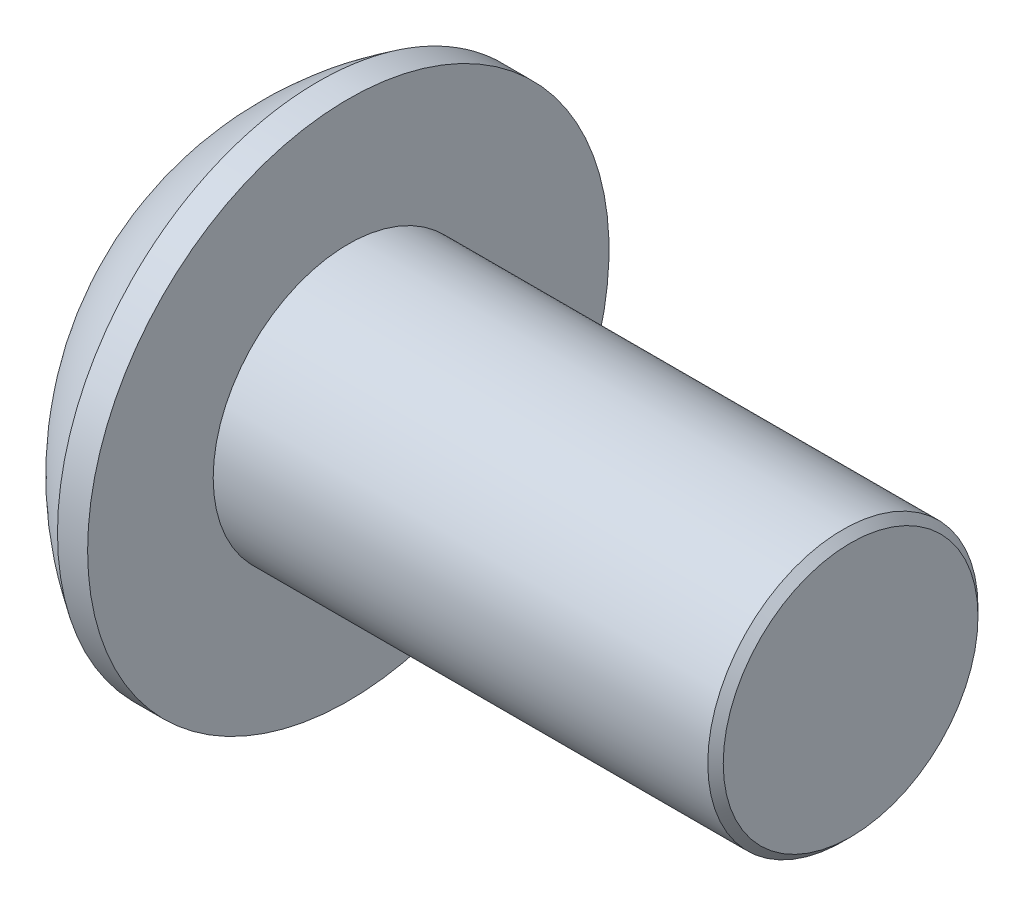
ISO-10303-21;
HEADER;
FILE_DESCRIPTION(('STEP AP214'),'2;1');
FILE_NAME('part.step','',(''),(''),'','','');
FILE_SCHEMA(('AUTOMOTIVE_DESIGN { 1 0 10303 214 1 1 1 1 }'));
ENDSEC;
DATA;
#1=APPLICATION_CONTEXT('core data for automotive mechanical design processes');
#2=APPLICATION_PROTOCOL_DEFINITION('international standard','automotive_design',2000,#1);
#3=PRODUCT_CONTEXT('',#1,'mechanical');
#4=PRODUCT('Part','Part','',(#3));
#5=PRODUCT_RELATED_PRODUCT_CATEGORY('part','',(#4));
#6=PRODUCT_DEFINITION_FORMATION('','',#4);
#7=PRODUCT_DEFINITION_CONTEXT('part definition',#1,'design');
#8=PRODUCT_DEFINITION('design','',#6,#7);
#9=PRODUCT_DEFINITION_SHAPE('','',#8);
#10=(LENGTH_UNIT() NAMED_UNIT(*) SI_UNIT(.MILLI.,.METRE.));
#11=(NAMED_UNIT(*) PLANE_ANGLE_UNIT() SI_UNIT($,.RADIAN.));
#12=(NAMED_UNIT(*) SI_UNIT($,.STERADIAN.) SOLID_ANGLE_UNIT());
#13=UNCERTAINTY_MEASURE_WITH_UNIT(LENGTH_MEASURE(1.E-05),#10,'distance_accuracy_value','');
#14=(GEOMETRIC_REPRESENTATION_CONTEXT(3) GLOBAL_UNCERTAINTY_ASSIGNED_CONTEXT((#13)) GLOBAL_UNIT_ASSIGNED_CONTEXT((#10,
#11,#12)) REPRESENTATION_CONTEXT('',''));
#15=CARTESIAN_POINT('',(0.,0.,0.));
#16=DIRECTION('',(0.,0.,1.));
#17=DIRECTION('',(1.,0.,0.));
#18=AXIS2_PLACEMENT_3D('',#15,#16,#17);
#19=CARTESIAN_POINT('',(1.32080000000034,0.,0.));
#20=DIRECTION('',(-1.,0.,0.));
#21=DIRECTION('',(0.,0.,1.));
#22=AXIS2_PLACEMENT_3D('',#19,#20,#21);
#23=CONICAL_SURFACE('',#22,1.1937999999998,1.04719755119608);
#24=CARTESIAN_POINT('',(2.01004075135902,0.,4.44089209850063E-13));
#25=VERTEX_POINT('',#24);
#26=VERTEX_LOOP('',#25);
#27=FACE_BOUND('',#26,.T.);
#28=CARTESIAN_POINT('',(1.32080000000009,0.,0.));
#29=DIRECTION('',(-1.,0.,0.));
#30=DIRECTION('',(0.,0.,1.));
#31=AXIS2_PLACEMENT_3D('',#28,#29,#30);
#32=CIRCLE('',#31,1.19380000000024);
#33=CARTESIAN_POINT('',(1.32080000000004,-1.03386112703797,0.59690000000006));
#34=VERTEX_POINT('',#33);
#35=CARTESIAN_POINT('',(1.32080000000004,0.,1.19380000000012));
#36=VERTEX_POINT('',#35);
#37=EDGE_CURVE('E18',#34,#36,#32,.T.);
#38=ORIENTED_EDGE('',*,*,#37,.T.);
#39=CARTESIAN_POINT('',(1.32080000000009,0.,0.));
#40=DIRECTION('',(-1.,0.,0.));
#41=DIRECTION('',(0.,0.,1.));
#42=AXIS2_PLACEMENT_3D('',#39,#40,#41);
#43=CIRCLE('',#42,1.19380000000024);
#44=CARTESIAN_POINT('',(1.32080000000004,1.03386112703797,0.596900000000061));
#45=VERTEX_POINT('',#44);
#46=EDGE_CURVE('E139',#36,#45,#43,.T.);
#47=ORIENTED_EDGE('',*,*,#46,.T.);
#48=CARTESIAN_POINT('',(1.32080000000009,0.,0.));
#49=DIRECTION('',(-1.,0.,0.));
#50=DIRECTION('',(0.,0.,1.));
#51=AXIS2_PLACEMENT_3D('',#48,#49,#50);
#52=CIRCLE('',#51,1.19380000000024);
#53=CARTESIAN_POINT('',(1.32080000000004,1.03386112703797,-0.596900000000061));
#54=VERTEX_POINT('',#53);
#55=EDGE_CURVE('E368',#45,#54,#52,.T.);
#56=ORIENTED_EDGE('',*,*,#55,.T.);
#57=CARTESIAN_POINT('',(1.32080000000009,0.,0.));
#58=DIRECTION('',(-1.,0.,0.));
#59=DIRECTION('',(0.,0.,1.));
#60=AXIS2_PLACEMENT_3D('',#57,#58,#59);
#61=CIRCLE('',#60,1.19380000000024);
#62=CARTESIAN_POINT('',(1.32080000000004,1.49457637585666E-12,-1.19380000000012));
#63=VERTEX_POINT('',#62);
#64=EDGE_CURVE('E366',#54,#63,#61,.T.);
#65=ORIENTED_EDGE('',*,*,#64,.T.);
#66=CARTESIAN_POINT('',(1.32080000000009,0.,0.));
#67=DIRECTION('',(-1.,0.,0.));
#68=DIRECTION('',(0.,0.,1.));
#69=AXIS2_PLACEMENT_3D('',#66,#67,#68);
#70=CIRCLE('',#69,1.19380000000024);
#71=CARTESIAN_POINT('',(1.32080000000004,-1.03386112703797,-0.59690000000006));
#72=VERTEX_POINT('',#71);
#73=EDGE_CURVE('E91',#63,#72,#70,.T.);
#74=ORIENTED_EDGE('',*,*,#73,.T.);
#75=CARTESIAN_POINT('',(1.32080000000009,0.,0.));
#76=DIRECTION('',(-1.,0.,0.));
#77=DIRECTION('',(0.,0.,1.));
#78=AXIS2_PLACEMENT_3D('',#75,#76,#77);
#79=CIRCLE('',#78,1.19380000000024);
#80=EDGE_CURVE('E87',#72,#34,#79,.T.);
#81=ORIENTED_EDGE('',*,*,#80,.T.);
#82=EDGE_LOOP('',(#38,#47,#56,#65,#74,#81));
#83=FACE_BOUND('',#82,.T.);
#84=ADVANCED_FACE('F14',(#27,#83),#23,.F.);
#85=CARTESIAN_POINT('',(1.3208,-2.06772225407572,-1.1938));
#86=DIRECTION('',(1.,0.,0.));
#87=DIRECTION('',(0.,0.,-1.));
#88=AXIS2_PLACEMENT_3D('',#85,#86,#87);
#89=PLANE('',#88);
#90=DIRECTION('',(0.,0.5,0.866025403784439));
#91=VECTOR('',#90,1.);
#92=CARTESIAN_POINT('',(1.3208,-1.37848150271715,0.));
#93=LINE('',#92,#91);
#94=CARTESIAN_POINT('',(1.3208,-0.689240751358574,1.1938));
#95=VERTEX_POINT('',#94);
#96=EDGE_CURVE('E99',#95,#34,#93,.F.);
#97=ORIENTED_EDGE('',*,*,#96,.F.);
#98=DIRECTION('',(0.,1.,0.));
#99=VECTOR('',#98,1.);
#100=CARTESIAN_POINT('',(1.3208,-0.689240751358574,1.1938));
#101=LINE('',#100,#99);
#102=EDGE_CURVE('E101',#36,#95,#101,.F.);
#103=ORIENTED_EDGE('',*,*,#102,.F.);
#104=ORIENTED_EDGE('',*,*,#37,.F.);
#105=EDGE_LOOP('',(#97,#103,#104));
#106=FACE_BOUND('',#105,.T.);
#107=ADVANCED_FACE('F97',(#106),#89,.F.);
#108=CARTESIAN_POINT('',(1.3208,-2.06772225407572,-1.1938));
#109=DIRECTION('',(1.,0.,0.));
#110=DIRECTION('',(0.,0.,-1.));
#111=AXIS2_PLACEMENT_3D('',#108,#109,#110);
#112=PLANE('',#111);
#113=DIRECTION('',(0.,-0.5,0.866025403784439));
#114=VECTOR('',#113,1.);
#115=CARTESIAN_POINT('',(1.3208,-0.689240751358574,-1.1938));
#116=LINE('',#115,#114);
#117=CARTESIAN_POINT('',(1.3208,-1.37848150271715,0.));
#118=VERTEX_POINT('',#117);
#119=EDGE_CURVE('E107',#118,#72,#116,.F.);
#120=ORIENTED_EDGE('',*,*,#119,.F.);
#121=DIRECTION('',(0.,0.5,0.866025403784439));
#122=VECTOR('',#121,1.);
#123=CARTESIAN_POINT('',(1.3208,-1.37848150271715,0.));
#124=LINE('',#123,#122);
#125=EDGE_CURVE('E104',#34,#118,#124,.F.);
#126=ORIENTED_EDGE('',*,*,#125,.F.);
#127=ORIENTED_EDGE('',*,*,#80,.F.);
#128=EDGE_LOOP('',(#120,#126,#127));
#129=FACE_BOUND('',#128,.T.);
#130=ADVANCED_FACE('F105',(#129),#112,.F.);
#131=CARTESIAN_POINT('',(1.3208,-2.06772225407572,-1.1938));
#132=DIRECTION('',(1.,0.,0.));
#133=DIRECTION('',(0.,0.,-1.));
#134=AXIS2_PLACEMENT_3D('',#131,#132,#133);
#135=PLANE('',#134);
#136=DIRECTION('',(0.,1.,0.));
#137=VECTOR('',#136,1.);
#138=CARTESIAN_POINT('',(1.3208,0.689240751358577,-1.1938));
#139=LINE('',#138,#137);
#140=CARTESIAN_POINT('',(1.3208,-0.689240751358574,-1.1938));
#141=VERTEX_POINT('',#140);
#142=EDGE_CURVE('E336',#141,#63,#139,.T.);
#143=ORIENTED_EDGE('',*,*,#142,.F.);
#144=DIRECTION('',(0.,-0.5,0.866025403784439));
#145=VECTOR('',#144,1.);
#146=CARTESIAN_POINT('',(1.3208,-0.689240751358574,-1.1938));
#147=LINE('',#146,#145);
#148=EDGE_CURVE('E341',#72,#141,#147,.F.);
#149=ORIENTED_EDGE('',*,*,#148,.F.);
#150=ORIENTED_EDGE('',*,*,#73,.F.);
#151=EDGE_LOOP('',(#143,#149,#150));
#152=FACE_BOUND('',#151,.T.);
#153=ADVANCED_FACE('F182',(#152),#135,.F.);
#154=CARTESIAN_POINT('',(1.3208,-2.06772225407572,-1.1938));
#155=DIRECTION('',(1.,0.,0.));
#156=DIRECTION('',(0.,0.,-1.));
#157=AXIS2_PLACEMENT_3D('',#154,#155,#156);
#158=PLANE('',#157);
#159=DIRECTION('',(0.,-0.5,-0.866025403784439));
#160=VECTOR('',#159,1.);
#161=CARTESIAN_POINT('',(1.3208,1.37848150271715,0.));
#162=LINE('',#161,#160);
#163=CARTESIAN_POINT('',(1.3208,0.689240751358577,-1.1938));
#164=VERTEX_POINT('',#163);
#165=EDGE_CURVE('E327',#164,#54,#162,.F.);
#166=ORIENTED_EDGE('',*,*,#165,.F.);
#167=DIRECTION('',(0.,1.,0.));
#168=VECTOR('',#167,1.);
#169=CARTESIAN_POINT('',(1.3208,0.689240751358577,-1.1938));
#170=LINE('',#169,#168);
#171=EDGE_CURVE('E333',#63,#164,#170,.T.);
#172=ORIENTED_EDGE('',*,*,#171,.F.);
#173=ORIENTED_EDGE('',*,*,#64,.F.);
#174=EDGE_LOOP('',(#166,#172,#173));
#175=FACE_BOUND('',#174,.T.);
#176=ADVANCED_FACE('F178',(#175),#158,.F.);
#177=CARTESIAN_POINT('',(1.3208,-2.06772225407572,-1.1938));
#178=DIRECTION('',(1.,0.,0.));
#179=DIRECTION('',(0.,0.,-1.));
#180=AXIS2_PLACEMENT_3D('',#177,#178,#179);
#181=PLANE('',#180);
#182=DIRECTION('',(0.,0.5,-0.866025403784439));
#183=VECTOR('',#182,1.);
#184=CARTESIAN_POINT('',(1.3208,0.689240751358576,1.1938));
#185=LINE('',#184,#183);
#186=CARTESIAN_POINT('',(1.3208,1.37848150271715,0.));
#187=VERTEX_POINT('',#186);
#188=EDGE_CURVE('E314',#187,#45,#185,.F.);
#189=ORIENTED_EDGE('',*,*,#188,.F.);
#190=DIRECTION('',(0.,-0.5,-0.866025403784439));
#191=VECTOR('',#190,1.);
#192=CARTESIAN_POINT('',(1.3208,1.37848150271715,0.));
#193=LINE('',#192,#191);
#194=EDGE_CURVE('E325',#54,#187,#193,.F.);
#195=ORIENTED_EDGE('',*,*,#194,.F.);
#196=ORIENTED_EDGE('',*,*,#55,.F.);
#197=EDGE_LOOP('',(#189,#195,#196));
#198=FACE_BOUND('',#197,.T.);
#199=ADVANCED_FACE('F174',(#198),#181,.F.);
#200=CARTESIAN_POINT('',(1.3208,-2.06772225407572,-1.1938));
#201=DIRECTION('',(1.,0.,0.));
#202=DIRECTION('',(0.,0.,-1.));
#203=AXIS2_PLACEMENT_3D('',#200,#201,#202);
#204=PLANE('',#203);
#205=DIRECTION('',(0.,1.,0.));
#206=VECTOR('',#205,1.);
#207=CARTESIAN_POINT('',(1.3208,-0.689240751358574,1.1938));
#208=LINE('',#207,#206);
#209=CARTESIAN_POINT('',(1.3208,0.689240751358576,1.1938));
#210=VERTEX_POINT('',#209);
#211=EDGE_CURVE('E116',#210,#36,#208,.F.);
#212=ORIENTED_EDGE('',*,*,#211,.F.);
#213=DIRECTION('',(0.,0.5,-0.866025403784439));
#214=VECTOR('',#213,1.);
#215=CARTESIAN_POINT('',(1.3208,0.689240751358576,1.1938));
#216=LINE('',#215,#214);
#217=EDGE_CURVE('E317',#45,#210,#216,.F.);
#218=ORIENTED_EDGE('',*,*,#217,.F.);
#219=ORIENTED_EDGE('',*,*,#46,.F.);
#220=EDGE_LOOP('',(#212,#218,#219));
#221=FACE_BOUND('',#220,.T.);
#222=ADVANCED_FACE('F170',(#221),#204,.F.);
#223=CARTESIAN_POINT('',(1.3208,-0.689240751358574,1.1938));
#224=DIRECTION('',(0.,0.,-1.));
#225=DIRECTION('',(0.,1.,0.));
#226=AXIS2_PLACEMENT_3D('',#223,#224,#225);
#227=PLANE('',#226);
#228=DIRECTION('',(0.,1.,0.));
#229=VECTOR('',#228,1.);
#230=CARTESIAN_POINT('',(0.,0.,1.1938));
#231=LINE('',#230,#229);
#232=CARTESIAN_POINT('',(0.,0.689240751358577,1.1938));
#233=VERTEX_POINT('',#232);
#234=CARTESIAN_POINT('',(0.,-0.689240751358574,1.1938));
#235=VERTEX_POINT('',#234);
#236=EDGE_CURVE('E329',#233,#235,#231,.F.);
#237=ORIENTED_EDGE('',*,*,#236,.F.);
#238=DIRECTION('',(1.,0.,0.));
#239=VECTOR('',#238,1.);
#240=CARTESIAN_POINT('',(1.3208,0.689240751358576,1.1938));
#241=LINE('',#240,#239);
#242=EDGE_CURVE('E321',#210,#233,#241,.F.);
#243=ORIENTED_EDGE('',*,*,#242,.F.);
#244=ORIENTED_EDGE('',*,*,#211,.T.);
#245=ORIENTED_EDGE('',*,*,#102,.T.);
#246=DIRECTION('',(1.,0.,0.));
#247=VECTOR('',#246,1.);
#248=CARTESIAN_POINT('',(1.3208,-0.689240751358574,1.1938));
#249=LINE('',#248,#247);
#250=EDGE_CURVE('E110',#235,#95,#249,.T.);
#251=ORIENTED_EDGE('',*,*,#250,.F.);
#252=EDGE_LOOP('',(#237,#243,#244,#245,#251));
#253=FACE_BOUND('',#252,.T.);
#254=ADVANCED_FACE('F167',(#253),#227,.T.);
#255=CARTESIAN_POINT('',(1.3208,-1.37848150271715,0.));
#256=DIRECTION('',(0.,0.866025403784439,-0.5));
#257=DIRECTION('',(0.,0.5,0.866025403784439));
#258=AXIS2_PLACEMENT_3D('',#255,#256,#257);
#259=PLANE('',#258);
#260=DIRECTION('',(0.,-0.5,-0.866025403784439));
#261=VECTOR('',#260,1.);
#262=CARTESIAN_POINT('',(0.,-0.689240751358574,1.1938));
#263=LINE('',#262,#261);
#264=CARTESIAN_POINT('',(0.,-1.37848150271715,0.));
#265=VERTEX_POINT('',#264);
#266=EDGE_CURVE('E350',#235,#265,#263,.T.);
#267=ORIENTED_EDGE('',*,*,#266,.F.);
#268=ORIENTED_EDGE('',*,*,#250,.T.);
#269=ORIENTED_EDGE('',*,*,#96,.T.);
#270=ORIENTED_EDGE('',*,*,#125,.T.);
#271=DIRECTION('',(1.,0.,0.));
#272=VECTOR('',#271,1.);
#273=CARTESIAN_POINT('',(1.3208,-1.37848150271715,0.));
#274=LINE('',#273,#272);
#275=EDGE_CURVE('E119',#265,#118,#274,.T.);
#276=ORIENTED_EDGE('',*,*,#275,.F.);
#277=EDGE_LOOP('',(#267,#268,#269,#270,#276));
#278=FACE_BOUND('',#277,.T.);
#279=ADVANCED_FACE('F114',(#278),#259,.T.);
#280=CARTESIAN_POINT('',(1.3208,-0.689240751358574,-1.1938));
#281=DIRECTION('',(0.,0.866025403784439,0.5));
#282=DIRECTION('',(0.,-0.5,0.866025403784439));
#283=AXIS2_PLACEMENT_3D('',#280,#281,#282);
#284=PLANE('',#283);
#285=DIRECTION('',(0.,0.5,-0.866025403784439));
#286=VECTOR('',#285,1.);
#287=CARTESIAN_POINT('',(0.,-1.37848150271715,0.));
#288=LINE('',#287,#286);
#289=CARTESIAN_POINT('',(0.,-0.689240751358574,-1.1938));
#290=VERTEX_POINT('',#289);
#291=EDGE_CURVE('E348',#265,#290,#288,.T.);
#292=ORIENTED_EDGE('',*,*,#291,.F.);
#293=ORIENTED_EDGE('',*,*,#275,.T.);
#294=ORIENTED_EDGE('',*,*,#119,.T.);
#295=ORIENTED_EDGE('',*,*,#148,.T.);
#296=DIRECTION('',(1.,0.,0.));
#297=VECTOR('',#296,1.);
#298=CARTESIAN_POINT('',(1.3208,-0.689240751358574,-1.1938));
#299=LINE('',#298,#297);
#300=EDGE_CURVE('E332',#290,#141,#299,.T.);
#301=ORIENTED_EDGE('',*,*,#300,.F.);
#302=EDGE_LOOP('',(#292,#293,#294,#295,#301));
#303=FACE_BOUND('',#302,.T.);
#304=ADVANCED_FACE('F160',(#303),#284,.T.);
#305=CARTESIAN_POINT('',(1.3208,0.689240751358577,-1.1938));
#306=DIRECTION('',(0.,0.,1.));
#307=DIRECTION('',(1.,0.,0.));
#308=AXIS2_PLACEMENT_3D('',#305,#306,#307);
#309=PLANE('',#308);
#310=DIRECTION('',(0.,1.,0.));
#311=VECTOR('',#310,1.);
#312=CARTESIAN_POINT('',(0.,0.,-1.1938));
#313=LINE('',#312,#311);
#314=CARTESIAN_POINT('',(0.,0.689240751358577,-1.1938));
#315=VERTEX_POINT('',#314);
#316=EDGE_CURVE('E358',#290,#315,#313,.T.);
#317=ORIENTED_EDGE('',*,*,#316,.F.);
#318=ORIENTED_EDGE('',*,*,#300,.T.);
#319=ORIENTED_EDGE('',*,*,#142,.T.);
#320=ORIENTED_EDGE('',*,*,#171,.T.);
#321=DIRECTION('',(1.,0.,0.));
#322=VECTOR('',#321,1.);
#323=CARTESIAN_POINT('',(1.3208,0.689240751358577,-1.1938));
#324=LINE('',#323,#322);
#325=EDGE_CURVE('E318',#315,#164,#324,.T.);
#326=ORIENTED_EDGE('',*,*,#325,.F.);
#327=EDGE_LOOP('',(#317,#318,#319,#320,#326));
#328=FACE_BOUND('',#327,.T.);
#329=ADVANCED_FACE('F157',(#328),#309,.T.);
#330=CARTESIAN_POINT('',(1.3208,1.37848150271715,0.));
#331=DIRECTION('',(0.,-0.866025403784439,0.5));
#332=DIRECTION('',(0.,-0.5,-0.866025403784439));
#333=AXIS2_PLACEMENT_3D('',#330,#331,#332);
#334=PLANE('',#333);
#335=DIRECTION('',(0.,0.5,0.866025403784439));
#336=VECTOR('',#335,1.);
#337=CARTESIAN_POINT('',(0.,0.689240751358577,-1.1938));
#338=LINE('',#337,#336);
#339=CARTESIAN_POINT('',(0.,1.37848150271715,0.));
#340=VERTEX_POINT('',#339);
#341=EDGE_CURVE('E361',#315,#340,#338,.T.);
#342=ORIENTED_EDGE('',*,*,#341,.F.);
#343=ORIENTED_EDGE('',*,*,#325,.T.);
#344=ORIENTED_EDGE('',*,*,#165,.T.);
#345=ORIENTED_EDGE('',*,*,#194,.T.);
#346=DIRECTION('',(1.,0.,0.));
#347=VECTOR('',#346,1.);
#348=CARTESIAN_POINT('',(1.3208,1.37848150271715,0.));
#349=LINE('',#348,#347);
#350=EDGE_CURVE('E33',#340,#187,#349,.T.);
#351=ORIENTED_EDGE('',*,*,#350,.F.);
#352=EDGE_LOOP('',(#342,#343,#344,#345,#351));
#353=FACE_BOUND('',#352,.T.);
#354=ADVANCED_FACE('F153',(#353),#334,.T.);
#355=CARTESIAN_POINT('',(1.3208,0.689240751358576,1.1938));
#356=DIRECTION('',(0.,-0.866025403784439,-0.5));
#357=DIRECTION('',(0.,0.5,-0.866025403784439));
#358=AXIS2_PLACEMENT_3D('',#355,#356,#357);
#359=PLANE('',#358);
#360=DIRECTION('',(0.,-0.5,0.866025403784439));
#361=VECTOR('',#360,1.);
#362=CARTESIAN_POINT('',(0.,1.37848150271715,0.));
#363=LINE('',#362,#361);
#364=EDGE_CURVE('E138',#340,#233,#363,.T.);
#365=ORIENTED_EDGE('',*,*,#364,.F.);
#366=ORIENTED_EDGE('',*,*,#350,.T.);
#367=ORIENTED_EDGE('',*,*,#188,.T.);
#368=ORIENTED_EDGE('',*,*,#217,.T.);
#369=ORIENTED_EDGE('',*,*,#242,.T.);
#370=EDGE_LOOP('',(#365,#366,#367,#368,#369));
#371=FACE_BOUND('',#370,.T.);
#372=ADVANCED_FACE('F149',(#371),#359,.T.);
#373=CARTESIAN_POINT('',(0.,0.,0.));
#374=DIRECTION('',(-1.,0.,0.));
#375=DIRECTION('',(0.,0.,1.));
#376=AXIS2_PLACEMENT_3D('',#373,#374,#375);
#377=PLANE('',#376);
#378=ORIENTED_EDGE('',*,*,#341,.T.);
#379=ORIENTED_EDGE('',*,*,#364,.T.);
#380=ORIENTED_EDGE('',*,*,#236,.T.);
#381=ORIENTED_EDGE('',*,*,#266,.T.);
#382=ORIENTED_EDGE('',*,*,#291,.T.);
#383=ORIENTED_EDGE('',*,*,#316,.T.);
#384=EDGE_LOOP('',(#378,#379,#380,#381,#382,#383));
#385=FACE_BOUND('',#384,.T.);
#386=CARTESIAN_POINT('',(0.,1.647825,0.));
#387=CARTESIAN_POINT('',(1.63319177039159E-13,1.64781976319874,0.0924902039777528));
#388=CARTESIAN_POINT('',(1.32889950928386E-13,1.63999511633709,0.185145014326369));
#389=CARTESIAN_POINT('',(0.,1.6167119250047,0.322075808080013));
#390=CARTESIAN_POINT('',(-1.58500534362179E-13,1.60700618770234,0.36743553339636));
#391=CARTESIAN_POINT('',(1.59063283897783E-13,1.58380101865853,0.457220935695139));
#392=CARTESIAN_POINT('',(5.69241819478296E-13,1.5702985083103,0.501645823115262));
#393=CARTESIAN_POINT('',(9.37394450765428E-13,1.52428156574313,0.632817459278965));
#394=CARTESIAN_POINT('',(0.,1.48621992666366,0.717681965518641));
#395=CARTESIAN_POINT('',(0.,1.39637079695658,0.879809706624014));
#396=CARTESIAN_POINT('',(7.82154613613799E-13,1.34458278455109,0.957072652379993));
#397=CARTESIAN_POINT('',(4.86997587203687E-13,1.25777784714521,1.06558770210237));
#398=CARTESIAN_POINT('',(1.33496382005463E-13,1.22729946114794,1.10054993332365));
#399=CARTESIAN_POINT('',(-1.32934199584443E-13,1.16354004969107,1.16775237388221));
#400=CARTESIAN_POINT('',(0.,1.13026175473033,1.19999517515816));
#401=CARTESIAN_POINT('',(0.,1.02649304340867,1.29236218866442));
#402=CARTESIAN_POINT('',(0.,0.952049986714081,1.34814848277712));
#403=CARTESIAN_POINT('',(0.,0.794895196754072,1.44639825105765));
#404=CARTESIAN_POINT('',(0.,0.712183775431299,1.48886222758992));
#405=CARTESIAN_POINT('',(0.,0.540796624265733,1.55930919813143));
#406=CARTESIAN_POINT('',(0.,0.45212095813529,1.58729234680268));
#407=CARTESIAN_POINT('',(0.,0.27133233108032,1.62797191307413));
#408=CARTESIAN_POINT('',(0.,0.179219351801792,1.64066824903626));
#409=CARTESIAN_POINT('',(0.,-0.00583077027840445,1.65041748705408));
#410=CARTESIAN_POINT('',(0.,-0.0987679130800736,1.64747038910978));
#411=CARTESIAN_POINT('',(0.,-0.28283019638882,1.62601274134435));
#412=CARTESIAN_POINT('',(0.,-0.373955346570014,1.60750227463794));
#413=CARTESIAN_POINT('',(0.,-0.551796068178799,1.55545413364523));
#414=CARTESIAN_POINT('',(0.,-0.638511592498161,1.52191629885844));
#415=CARTESIAN_POINT('',(0.,-0.805120175533148,1.44072378052347));
#416=CARTESIAN_POINT('',(0.,-0.885012976819951,1.39306856461393));
#417=CARTESIAN_POINT('',(0.,-0.997912879588353,1.31211658756413));
#418=CARTESIAN_POINT('',(0.,-1.03439492468339,1.28354906167734));
#419=CARTESIAN_POINT('',(0.,-1.10486279842068,1.22341829303709));
#420=CARTESIAN_POINT('',(0.,-1.1388461840329,1.19185218578117));
#421=CARTESIAN_POINT('',(0.,-1.23657300939908,1.09305906467359));
#422=CARTESIAN_POINT('',(0.,-1.29619288399356,1.02166556658612));
#423=CARTESIAN_POINT('',(0.,-1.40258050817755,0.869876423478032));
#424=CARTESIAN_POINT('',(0.,-1.44934874627765,0.789481120793476));
#425=CARTESIAN_POINT('',(0.,-1.50889406070375,0.663870959313341));
#426=CARTESIAN_POINT('',(0.,-1.52698985473586,0.621110806760428));
#427=CARTESIAN_POINT('',(0.,-1.55950093966664,0.534260776864332));
#428=CARTESIAN_POINT('',(-1.0510766624734E-13,-1.57391920916437,0.490172008203169));
#429=CARTESIAN_POINT('',(2.10313601541921E-13,-1.61146177909579,0.356445777718597));
#430=CARTESIAN_POINT('',(1.14393266595326E-12,-1.62897899568074,0.265126085962907));
#431=CARTESIAN_POINT('',(4.34745316852023E-13,-1.64174347214908,0.144386595969389));
#432=CARTESIAN_POINT('',(1.21685678405718E-13,-1.64402207668915,0.115560405797875));
#433=CARTESIAN_POINT('',(-1.21251997536799E-13,-1.6470636594012,0.0578281757252698));
#434=CARTESIAN_POINT('',(0.,-1.64782663757318,0.028922135824178));
#435=CARTESIAN_POINT('',(1.63508926115257E-13,-1.64781976319874,-0.0924902039777537));
#436=CARTESIAN_POINT('',(1.32795238224012E-13,-1.63999511633709,-0.18514501432637));
#437=CARTESIAN_POINT('',(0.,-1.6167119250047,-0.322075808080014));
#438=CARTESIAN_POINT('',(-1.58310280081741E-13,-1.60700618770234,-0.367435533396361));
#439=CARTESIAN_POINT('',(1.58872874902927E-13,-1.58380101865853,-0.45722093569514));
#440=CARTESIAN_POINT('',(5.68527431903721E-13,-1.5702985083103,-0.501645823115263));
#441=CARTESIAN_POINT('',(9.36221869910377E-13,-1.52428156574313,-0.632817459278966));
#442=CARTESIAN_POINT('',(0.,-1.48621992666366,-0.717681965518643));
#443=CARTESIAN_POINT('',(0.,-1.39637079695658,-0.879809706624015));
#444=CARTESIAN_POINT('',(7.80985335845033E-13,-1.34458278455109,-0.957072652379992));
#445=CARTESIAN_POINT('',(4.86281381292483E-13,-1.25777784714521,-1.06558770210237));
#446=CARTESIAN_POINT('',(1.3330030747661E-13,-1.22729946114794,-1.10054993332365));
#447=CARTESIAN_POINT('',(-1.32738314100968E-13,-1.16354004969107,-1.16775237388221));
#448=CARTESIAN_POINT('',(0.,-1.13026175473033,-1.19999517515816));
#449=CARTESIAN_POINT('',(0.,-1.02649304340867,-1.29236218866442));
#450=CARTESIAN_POINT('',(0.,-0.952049986714081,-1.34814848277713));
#451=CARTESIAN_POINT('',(0.,-0.794895196754072,-1.44639825105765));
#452=CARTESIAN_POINT('',(0.,-0.7121837754313,-1.48886222758991));
#453=CARTESIAN_POINT('',(0.,-0.540796624265734,-1.55930919813143));
#454=CARTESIAN_POINT('',(0.,-0.452120958135291,-1.58729234680268));
#455=CARTESIAN_POINT('',(0.,-0.271332331080322,-1.62797191307413));
#456=CARTESIAN_POINT('',(0.,-0.179219351801793,-1.64066824903626));
#457=CARTESIAN_POINT('',(0.,0.00583077027840386,-1.65041748705408));
#458=CARTESIAN_POINT('',(0.,0.098767913080073,-1.64747038910978));
#459=CARTESIAN_POINT('',(0.,0.28283019638882,-1.62601274134436));
#460=CARTESIAN_POINT('',(0.,0.373955346570014,-1.60750227463794));
#461=CARTESIAN_POINT('',(0.,0.551796068178799,-1.55545413364523));
#462=CARTESIAN_POINT('',(0.,0.638511592498161,-1.52191629885844));
#463=CARTESIAN_POINT('',(0.,0.805120175533147,-1.44072378052347));
#464=CARTESIAN_POINT('',(0.,0.885012976819949,-1.39306856461393));
#465=CARTESIAN_POINT('',(0.,0.997912879588353,-1.31211658756413));
#466=CARTESIAN_POINT('',(0.,1.03439492468339,-1.28354906167734));
#467=CARTESIAN_POINT('',(0.,1.10486279842068,-1.22341829303709));
#468=CARTESIAN_POINT('',(0.,1.1388461840329,-1.19185218578117));
#469=CARTESIAN_POINT('',(0.,1.23657300939908,-1.09305906467358));
#470=CARTESIAN_POINT('',(0.,1.29619288399356,-1.02166556658612));
#471=CARTESIAN_POINT('',(0.,1.40258050817755,-0.869876423478031));
#472=CARTESIAN_POINT('',(0.,1.44934874627765,-0.789481120793476));
#473=CARTESIAN_POINT('',(0.,1.50889406070375,-0.66387095931334));
#474=CARTESIAN_POINT('',(0.,1.52698985473586,-0.621110806760427));
#475=CARTESIAN_POINT('',(0.,1.55950093966664,-0.534260776864331));
#476=CARTESIAN_POINT('',(-1.0516333620321E-13,1.57391920916437,-0.490172008203168));
#477=CARTESIAN_POINT('',(2.10424649557123E-13,1.61146177909579,-0.356445777718596));
#478=CARTESIAN_POINT('',(1.1439193537722E-12,1.62897899568074,-0.265126085962906));
#479=CARTESIAN_POINT('',(4.34749479635671E-13,1.64174347214908,-0.144386595969388));
#480=CARTESIAN_POINT('',(1.21707466173689E-13,1.64402207668915,-0.115560405797875));
#481=CARTESIAN_POINT('',(-1.21273785304769E-13,1.6470636594012,-0.0578281757252702));
#482=CARTESIAN_POINT('',(0.,1.64782663757318,-0.0289221358241786));
#483=CARTESIAN_POINT('',(0.,1.647825,0.));
#484=B_SPLINE_CURVE_WITH_KNOTS('',3,(#386,#387,#388,#389,#390,#391,#392,#393,#394,#395,#396,
#397,#398,#399,#400,#401,#402,#403,#404,#405,#406,#407,#408,#409,#410,#411,#412,#413,#414,#415,
#416,#417,#418,#419,#420,#421,#422,#423,#424,#425,#426,#427,#428,#429,#430,#431,#432,#433,#434,
#435,#436,#437,#438,#439,#440,#441,#442,#443,#444,#445,#446,#447,#448,#449,#450,#451,#452,#453,
#454,#455,#456,#457,#458,#459,#460,#461,#462,#463,#464,#465,#466,#467,#468,#469,#470,#471,#472,
#473,#474,#475,#476,#477,#478,#479,#480,#481,#482,#483),.UNSPECIFIED.,.T.,.F.,(4,2,2,2,2,2,2,2,
2,2,2,2,2,2,2,2,2,2,2,2,2,2,2,2,2,2,2,2,2,2,2,2,2,2,2,2,2,2,2,2,2,2,2,2,2,2,2,2,4),(0.,
0.277336029422425,0.41636854153711,0.555514114625598,0.833141970294985,1.11078038089036,
1.24978149120748,1.38864858351854,1.66629367015055,1.94392828594774,2.22155993641642,
2.49919306954937,2.77682620268234,3.05445785315101,3.3320924689482,3.6097375555799,
3.74860464789074,3.88760575820767,4.16524416880332,4.44287202447287,4.5820175975616,
4.72105010967661,4.99838613909882,5.08511046196676,5.17183478483476,5.44917081425719,
5.58820332637187,5.72734889946036,6.00497675512975,6.28261516572512,6.42161627604224,
6.5604833683533,6.83812845498532,7.1157630707825,7.39339472125118,7.67102785438413,
7.9486609875171,8.22629263798577,8.50392725378296,8.78157234041466,8.9204394327255,
9.05944054304243,9.33707895363808,9.61470680930763,9.75385238239636,9.89288489451138,
10.1702209239336,10.2569452468015,10.3436695696695),.UNSPECIFIED.);
#485=CARTESIAN_POINT('',(0.,1.647825,0.));
#486=VERTEX_POINT('',#485);
#487=EDGE_CURVE('E131',#486,#486,#484,.T.);
#488=ORIENTED_EDGE('',*,*,#487,.F.);
#489=EDGE_LOOP('',(#488));
#490=FACE_BOUND('',#489,.T.);
#491=ADVANCED_FACE('F145',(#385,#490),#377,.T.);
#492=CARTESIAN_POINT('',(3.50132362607759,0.,0.));
#493=DIRECTION('',(0.,1.,0.));
#494=DIRECTION('',(1.,0.,0.));
#495=AXIS2_PLACEMENT_3D('',#492,#493,#494);
#496=SPHERICAL_SURFACE('',#495,3.86970210289553);
#497=CARTESIAN_POINT('',(1.4732,0.,0.));
#498=DIRECTION('',(-1.,0.,0.));
#499=DIRECTION('',(0.,0.,1.));
#500=AXIS2_PLACEMENT_3D('',#497,#498,#499);
#501=CIRCLE('',#500,3.29565);
#502=CARTESIAN_POINT('',(1.4732,0.,3.29565));
#503=VERTEX_POINT('',#502);
#504=EDGE_CURVE('E128',#503,#503,#501,.F.);
#505=ORIENTED_EDGE('',*,*,#504,.F.);
#506=EDGE_LOOP('',(#505));
#507=FACE_BOUND('',#506,.T.);
#508=ORIENTED_EDGE('',*,*,#487,.T.);
#509=EDGE_LOOP('',(#508));
#510=FACE_BOUND('',#509,.T.);
#511=ADVANCED_FACE('F141',(#507,#510),#496,.T.);
#512=CARTESIAN_POINT('',(8.2042,0.,0.));
#513=DIRECTION('',(-1.,0.,0.));
#514=DIRECTION('',(0.,0.,1.));
#515=AXIS2_PLACEMENT_3D('',#512,#513,#514);
#516=PLANE('',#515);
#517=CARTESIAN_POINT('',(8.20419999996602,0.,0.));
#518=DIRECTION('',(-1.,0.,0.));
#519=DIRECTION('',(0.,0.,1.));
#520=AXIS2_PLACEMENT_3D('',#517,#518,#519);
#521=CIRCLE('',#520,1.61036000002923);
#522=CARTESIAN_POINT('',(8.20419999996602,0.,1.61036000002923));
#523=VERTEX_POINT('',#522);
#524=EDGE_CURVE('E125',#523,#523,#521,.T.);
#525=ORIENTED_EDGE('',*,*,#524,.F.);
#526=EDGE_LOOP('',(#525));
#527=FACE_BOUND('',#526,.T.);
#528=ADVANCED_FACE('F213',(#527),#516,.F.);
#529=CARTESIAN_POINT('',(0.,0.,0.));
#530=DIRECTION('',(-1.,0.,0.));
#531=DIRECTION('',(0.,0.,1.));
#532=AXIS2_PLACEMENT_3D('',#529,#530,#531);
#533=CYLINDRICAL_SURFACE('',#532,3.29565);
#534=ORIENTED_EDGE('',*,*,#504,.T.);
#535=EDGE_LOOP('',(#534));
#536=FACE_BOUND('',#535,.T.);
#537=CARTESIAN_POINT('',(1.8542,0.,0.));
#538=DIRECTION('',(-1.,0.,0.));
#539=DIRECTION('',(0.,0.,1.));
#540=AXIS2_PLACEMENT_3D('',#537,#538,#539);
#541=CIRCLE('',#540,3.29565);
#542=CARTESIAN_POINT('',(1.8542,0.,3.29565));
#543=VERTEX_POINT('',#542);
#544=EDGE_CURVE('E122',#543,#543,#541,.T.);
#545=ORIENTED_EDGE('',*,*,#544,.T.);
#546=EDGE_LOOP('',(#545));
#547=FACE_BOUND('',#546,.T.);
#548=ADVANCED_FACE('F211',(#536,#547),#533,.T.);
#549=CARTESIAN_POINT('',(8.10640999998213,0.,0.));
#550=DIRECTION('',(-1.,0.,0.));
#551=DIRECTION('',(0.,0.,1.));
#552=AXIS2_PLACEMENT_3D('',#549,#550,#551);
#553=CONICAL_SURFACE('',#552,1.70814999995628,0.785398163106808);
#554=ORIENTED_EDGE('',*,*,#524,.T.);
#555=EDGE_LOOP('',(#554));
#556=FACE_BOUND('',#555,.T.);
#557=CARTESIAN_POINT('',(8.10641,0.,0.));
#558=DIRECTION('',(-1.,0.,0.));
#559=DIRECTION('',(0.,0.,1.));
#560=AXIS2_PLACEMENT_3D('',#557,#558,#559);
#561=CIRCLE('',#560,1.70815);
#562=CARTESIAN_POINT('',(8.10641,0.,1.70815));
#563=VERTEX_POINT('',#562);
#564=EDGE_CURVE('E24',#563,#563,#561,.T.);
#565=ORIENTED_EDGE('',*,*,#564,.F.);
#566=EDGE_LOOP('',(#565));
#567=FACE_BOUND('',#566,.T.);
#568=ADVANCED_FACE('F202',(#556,#567),#553,.T.);
#569=CARTESIAN_POINT('',(1.8542,1.70815,0.));
#570=DIRECTION('',(-1.,0.,0.));
#571=DIRECTION('',(0.,0.,1.));
#572=AXIS2_PLACEMENT_3D('',#569,#570,#571);
#573=PLANE('',#572);
#574=CARTESIAN_POINT('',(1.8542,0.,0.));
#575=DIRECTION('',(-1.,0.,0.));
#576=DIRECTION('',(0.,0.,1.));
#577=AXIS2_PLACEMENT_3D('',#574,#575,#576);
#578=CIRCLE('',#577,1.70815);
#579=CARTESIAN_POINT('',(1.8542,0.,1.70815));
#580=VERTEX_POINT('',#579);
#581=EDGE_CURVE('E9',#580,#580,#578,.F.);
#582=ORIENTED_EDGE('',*,*,#581,.F.);
#583=EDGE_LOOP('',(#582));
#584=FACE_BOUND('',#583,.T.);
#585=ORIENTED_EDGE('',*,*,#544,.F.);
#586=EDGE_LOOP('',(#585));
#587=FACE_BOUND('',#586,.T.);
#588=ADVANCED_FACE('F197',(#584,#587),#573,.F.);
#589=CARTESIAN_POINT('',(0.,0.,0.));
#590=DIRECTION('',(-1.,0.,0.));
#591=DIRECTION('',(0.,0.,1.));
#592=AXIS2_PLACEMENT_3D('',#589,#590,#591);
#593=CYLINDRICAL_SURFACE('',#592,1.70815);
#594=ORIENTED_EDGE('',*,*,#564,.T.);
#595=EDGE_LOOP('',(#594));
#596=FACE_BOUND('',#595,.T.);
#597=ORIENTED_EDGE('',*,*,#581,.T.);
#598=EDGE_LOOP('',(#597));
#599=FACE_BOUND('',#598,.T.);
#600=ADVANCED_FACE('F16',(#596,#599),#593,.T.);
#601=CLOSED_SHELL('',(#84,#107,#130,#153,#176,#199,#222,#254,#279,#304,#329,#354,#372,#491,#511,
#528,#548,#568,#588,#600));
#602=MANIFOLD_SOLID_BREP('B1',#601);
#603=ADVANCED_BREP_SHAPE_REPRESENTATION('',(#18,#602),#14);
#604=SHAPE_DEFINITION_REPRESENTATION(#9,#603);
ENDSEC;
END-ISO-10303-21;
